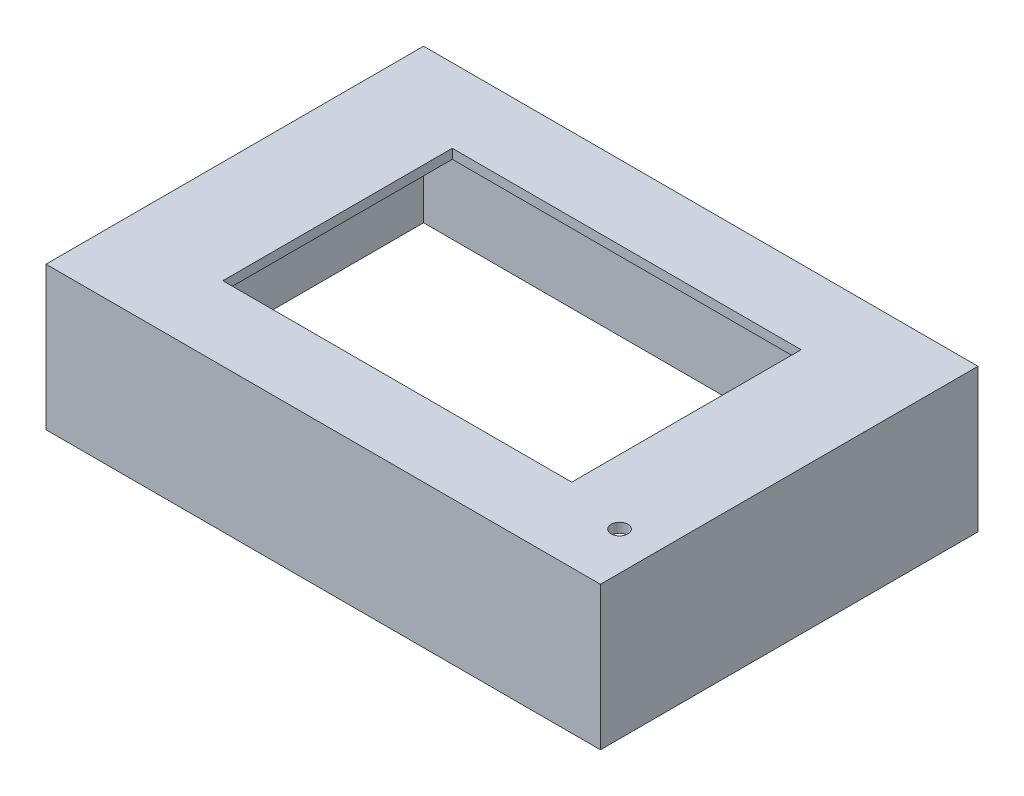
ISO-10303-21;
HEADER;
FILE_DESCRIPTION(('STEP AP214'),'2;1');
FILE_NAME('part.step','',(''),(''),'','','');
FILE_SCHEMA(('AUTOMOTIVE_DESIGN { 1 0 10303 214 1 1 1 1 }'));
ENDSEC;
DATA;
#1=APPLICATION_CONTEXT('core data for automotive mechanical design processes');
#2=APPLICATION_PROTOCOL_DEFINITION('international standard','automotive_design',2000,#1);
#3=PRODUCT_CONTEXT('',#1,'mechanical');
#4=PRODUCT('Part','Part','',(#3));
#5=PRODUCT_RELATED_PRODUCT_CATEGORY('part','',(#4));
#6=PRODUCT_DEFINITION_FORMATION('','',#4);
#7=PRODUCT_DEFINITION_CONTEXT('part definition',#1,'design');
#8=PRODUCT_DEFINITION('design','',#6,#7);
#9=PRODUCT_DEFINITION_SHAPE('','',#8);
#10=(LENGTH_UNIT() NAMED_UNIT(*) SI_UNIT(.MILLI.,.METRE.));
#11=(NAMED_UNIT(*) PLANE_ANGLE_UNIT() SI_UNIT($,.RADIAN.));
#12=(NAMED_UNIT(*) SI_UNIT($,.STERADIAN.) SOLID_ANGLE_UNIT());
#13=UNCERTAINTY_MEASURE_WITH_UNIT(LENGTH_MEASURE(1.E-05),#10,'distance_accuracy_value','');
#14=(GEOMETRIC_REPRESENTATION_CONTEXT(3) GLOBAL_UNCERTAINTY_ASSIGNED_CONTEXT((#13)) GLOBAL_UNIT_ASSIGNED_CONTEXT((#10,
#11,#12)) REPRESENTATION_CONTEXT('',''));
#15=CARTESIAN_POINT('',(0.,0.,0.));
#16=DIRECTION('',(0.,0.,1.));
#17=DIRECTION('',(1.,0.,0.));
#18=AXIS2_PLACEMENT_3D('',#15,#16,#17);
#19=CARTESIAN_POINT('',(0.,0.,0.));
#20=DIRECTION('',(0.,1.,0.));
#21=DIRECTION('',(0.,0.,1.));
#22=AXIS2_PLACEMENT_3D('',#19,#20,#21);
#23=PLANE('',#22);
#24=DIRECTION('',(0.,0.,-1.));
#25=VECTOR('',#24,1.);
#26=CARTESIAN_POINT('',(58.,0.,39.5));
#27=LINE('',#26,#25);
#28=CARTESIAN_POINT('',(58.,0.,39.5));
#29=VERTEX_POINT('',#28);
#30=CARTESIAN_POINT('',(58.,0.,-39.5));
#31=VERTEX_POINT('',#30);
#32=EDGE_CURVE('E199',#29,#31,#27,.T.);
#33=ORIENTED_EDGE('',*,*,#32,.F.);
#34=DIRECTION('',(1.,0.,0.));
#35=VECTOR('',#34,1.);
#36=CARTESIAN_POINT('',(58.,0.,39.5));
#37=LINE('',#36,#35);
#38=CARTESIAN_POINT('',(-58.,0.,39.5));
#39=VERTEX_POINT('',#38);
#40=EDGE_CURVE('E206',#39,#29,#37,.T.);
#41=ORIENTED_EDGE('',*,*,#40,.F.);
#42=DIRECTION('',(0.,0.,1.));
#43=VECTOR('',#42,1.);
#44=CARTESIAN_POINT('',(-58.,0.,39.5));
#45=LINE('',#44,#43);
#46=CARTESIAN_POINT('',(-58.,0.,-39.5));
#47=VERTEX_POINT('',#46);
#48=EDGE_CURVE('E204',#47,#39,#45,.T.);
#49=ORIENTED_EDGE('',*,*,#48,.F.);
#50=DIRECTION('',(-1.,0.,0.));
#51=VECTOR('',#50,1.);
#52=CARTESIAN_POINT('',(58.,0.,-39.5));
#53=LINE('',#52,#51);
#54=EDGE_CURVE('E202',#31,#47,#53,.T.);
#55=ORIENTED_EDGE('',*,*,#54,.F.);
#56=EDGE_LOOP('',(#33,#41,#49,#55));
#57=FACE_BOUND('',#56,.T.);
#58=DIRECTION('',(0.,0.,1.));
#59=VECTOR('',#58,1.);
#60=CARTESIAN_POINT('',(-56.,0.,37.5));
#61=LINE('',#60,#59);
#62=CARTESIAN_POINT('',(-56.,0.,-37.5));
#63=VERTEX_POINT('',#62);
#64=CARTESIAN_POINT('',(-56.,0.,37.5));
#65=VERTEX_POINT('',#64);
#66=EDGE_CURVE('E165',#63,#65,#61,.T.);
#67=ORIENTED_EDGE('',*,*,#66,.T.);
#68=DIRECTION('',(1.,0.,0.));
#69=VECTOR('',#68,1.);
#70=CARTESIAN_POINT('',(56.,0.,37.5));
#71=LINE('',#70,#69);
#72=CARTESIAN_POINT('',(56.,0.,37.5));
#73=VERTEX_POINT('',#72);
#74=EDGE_CURVE('E182',#65,#73,#71,.T.);
#75=ORIENTED_EDGE('',*,*,#74,.T.);
#76=DIRECTION('',(0.,0.,-1.));
#77=VECTOR('',#76,1.);
#78=CARTESIAN_POINT('',(56.,0.,37.5));
#79=LINE('',#78,#77);
#80=CARTESIAN_POINT('',(56.,0.,-37.5));
#81=VERTEX_POINT('',#80);
#82=EDGE_CURVE('E185',#73,#81,#79,.T.);
#83=ORIENTED_EDGE('',*,*,#82,.T.);
#84=DIRECTION('',(-1.,0.,0.));
#85=VECTOR('',#84,1.);
#86=CARTESIAN_POINT('',(56.,0.,-37.5));
#87=LINE('',#86,#85);
#88=EDGE_CURVE('E170',#81,#63,#87,.T.);
#89=ORIENTED_EDGE('',*,*,#88,.T.);
#90=EDGE_LOOP('',(#67,#75,#83,#89));
#91=FACE_BOUND('',#90,.T.);
#92=ADVANCED_FACE('F33',(#57,#91),#23,.F.);
#93=CARTESIAN_POINT('',(58.,28.,39.5));
#94=DIRECTION('',(-1.,0.,0.));
#95=DIRECTION('',(0.,0.,1.));
#96=AXIS2_PLACEMENT_3D('',#93,#94,#95);
#97=PLANE('',#96);
#98=ORIENTED_EDGE('',*,*,#32,.T.);
#99=DIRECTION('',(0.,-1.,0.));
#100=VECTOR('',#99,1.);
#101=CARTESIAN_POINT('',(58.,28.,-39.5));
#102=LINE('',#101,#100);
#103=CARTESIAN_POINT('',(58.,30.,-39.5));
#104=VERTEX_POINT('',#103);
#105=EDGE_CURVE('E11',#104,#31,#102,.T.);
#106=ORIENTED_EDGE('',*,*,#105,.F.);
#107=DIRECTION('',(0.,0.,-1.));
#108=VECTOR('',#107,1.);
#109=CARTESIAN_POINT('',(58.,30.,39.5));
#110=LINE('',#109,#108);
#111=CARTESIAN_POINT('',(58.,30.,39.5));
#112=VERTEX_POINT('',#111);
#113=EDGE_CURVE('E159',#112,#104,#110,.T.);
#114=ORIENTED_EDGE('',*,*,#113,.F.);
#115=DIRECTION('',(0.,-1.,0.));
#116=VECTOR('',#115,1.);
#117=CARTESIAN_POINT('',(58.,28.,39.5));
#118=LINE('',#117,#116);
#119=EDGE_CURVE('E208',#112,#29,#118,.T.);
#120=ORIENTED_EDGE('',*,*,#119,.T.);
#121=EDGE_LOOP('',(#98,#106,#114,#120));
#122=FACE_BOUND('',#121,.T.);
#123=ADVANCED_FACE('F35',(#122),#97,.F.);
#124=CARTESIAN_POINT('',(58.,28.,-39.5));
#125=DIRECTION('',(0.,0.,1.));
#126=DIRECTION('',(1.,0.,0.));
#127=AXIS2_PLACEMENT_3D('',#124,#125,#126);
#128=PLANE('',#127);
#129=ORIENTED_EDGE('',*,*,#54,.T.);
#130=DIRECTION('',(0.,-1.,0.));
#131=VECTOR('',#130,1.);
#132=CARTESIAN_POINT('',(-58.,28.,-39.5));
#133=LINE('',#132,#131);
#134=CARTESIAN_POINT('',(-58.,30.,-39.5));
#135=VERTEX_POINT('',#134);
#136=EDGE_CURVE('E41',#135,#47,#133,.T.);
#137=ORIENTED_EDGE('',*,*,#136,.F.);
#138=DIRECTION('',(-1.,0.,0.));
#139=VECTOR('',#138,1.);
#140=CARTESIAN_POINT('',(58.,30.,-39.5));
#141=LINE('',#140,#139);
#142=EDGE_CURVE('E162',#104,#135,#141,.T.);
#143=ORIENTED_EDGE('',*,*,#142,.F.);
#144=ORIENTED_EDGE('',*,*,#105,.T.);
#145=EDGE_LOOP('',(#129,#137,#143,#144));
#146=FACE_BOUND('',#145,.T.);
#147=ADVANCED_FACE('F229',(#146),#128,.F.);
#148=CARTESIAN_POINT('',(-58.,28.,39.5));
#149=DIRECTION('',(1.,0.,0.));
#150=DIRECTION('',(0.,0.,-1.));
#151=AXIS2_PLACEMENT_3D('',#148,#149,#150);
#152=PLANE('',#151);
#153=ORIENTED_EDGE('',*,*,#48,.T.);
#154=DIRECTION('',(0.,-1.,0.));
#155=VECTOR('',#154,1.);
#156=CARTESIAN_POINT('',(-58.,28.,39.5));
#157=LINE('',#156,#155);
#158=CARTESIAN_POINT('',(-58.,30.,39.5));
#159=VERTEX_POINT('',#158);
#160=EDGE_CURVE('E211',#159,#39,#157,.T.);
#161=ORIENTED_EDGE('',*,*,#160,.F.);
#162=DIRECTION('',(0.,0.,1.));
#163=VECTOR('',#162,1.);
#164=CARTESIAN_POINT('',(-58.,30.,39.5));
#165=LINE('',#164,#163);
#166=EDGE_CURVE('E152',#135,#159,#165,.T.);
#167=ORIENTED_EDGE('',*,*,#166,.F.);
#168=ORIENTED_EDGE('',*,*,#136,.T.);
#169=EDGE_LOOP('',(#153,#161,#167,#168));
#170=FACE_BOUND('',#169,.T.);
#171=ADVANCED_FACE('F217',(#170),#152,.F.);
#172=CARTESIAN_POINT('',(58.,28.,39.5));
#173=DIRECTION('',(0.,0.,-1.));
#174=DIRECTION('',(-1.,0.,0.));
#175=AXIS2_PLACEMENT_3D('',#172,#173,#174);
#176=PLANE('',#175);
#177=ORIENTED_EDGE('',*,*,#40,.T.);
#178=ORIENTED_EDGE('',*,*,#119,.F.);
#179=DIRECTION('',(1.,0.,0.));
#180=VECTOR('',#179,1.);
#181=CARTESIAN_POINT('',(58.,30.,39.5));
#182=LINE('',#181,#180);
#183=EDGE_CURVE('E156',#159,#112,#182,.T.);
#184=ORIENTED_EDGE('',*,*,#183,.F.);
#185=ORIENTED_EDGE('',*,*,#160,.T.);
#186=EDGE_LOOP('',(#177,#178,#184,#185));
#187=FACE_BOUND('',#186,.T.);
#188=ADVANCED_FACE('F225',(#187),#176,.F.);
#189=CARTESIAN_POINT('',(-56.,28.,37.5));
#190=DIRECTION('',(1.,0.,0.));
#191=DIRECTION('',(0.,0.,-1.));
#192=AXIS2_PLACEMENT_3D('',#189,#190,#191);
#193=PLANE('',#192);
#194=ORIENTED_EDGE('',*,*,#66,.F.);
#195=DIRECTION('',(0.,-1.,0.));
#196=VECTOR('',#195,1.);
#197=CARTESIAN_POINT('',(-56.,28.,-37.5));
#198=LINE('',#197,#196);
#199=CARTESIAN_POINT('',(-56.,28.,-37.5));
#200=VERTEX_POINT('',#199);
#201=EDGE_CURVE('E179',#200,#63,#198,.T.);
#202=ORIENTED_EDGE('',*,*,#201,.F.);
#203=DIRECTION('',(0.,0.,1.));
#204=VECTOR('',#203,1.);
#205=CARTESIAN_POINT('',(-56.,28.,37.5));
#206=LINE('',#205,#204);
#207=CARTESIAN_POINT('',(-56.,28.,37.5));
#208=VERTEX_POINT('',#207);
#209=EDGE_CURVE('E166',#200,#208,#206,.T.);
#210=ORIENTED_EDGE('',*,*,#209,.T.);
#211=DIRECTION('',(0.,-1.,0.));
#212=VECTOR('',#211,1.);
#213=CARTESIAN_POINT('',(-56.,28.,37.5));
#214=LINE('',#213,#212);
#215=EDGE_CURVE('E196',#208,#65,#214,.T.);
#216=ORIENTED_EDGE('',*,*,#215,.T.);
#217=EDGE_LOOP('',(#194,#202,#210,#216));
#218=FACE_BOUND('',#217,.T.);
#219=ADVANCED_FACE('F242',(#218),#193,.T.);
#220=CARTESIAN_POINT('',(56.,28.,37.5));
#221=DIRECTION('',(0.,0.,-1.));
#222=DIRECTION('',(-1.,0.,0.));
#223=AXIS2_PLACEMENT_3D('',#220,#221,#222);
#224=PLANE('',#223);
#225=ORIENTED_EDGE('',*,*,#74,.F.);
#226=ORIENTED_EDGE('',*,*,#215,.F.);
#227=DIRECTION('',(1.,0.,0.));
#228=VECTOR('',#227,1.);
#229=CARTESIAN_POINT('',(56.,28.,37.5));
#230=LINE('',#229,#228);
#231=CARTESIAN_POINT('',(56.,28.,37.5));
#232=VERTEX_POINT('',#231);
#233=EDGE_CURVE('E169',#208,#232,#230,.T.);
#234=ORIENTED_EDGE('',*,*,#233,.T.);
#235=DIRECTION('',(0.,-1.,0.));
#236=VECTOR('',#235,1.);
#237=CARTESIAN_POINT('',(56.,28.,37.5));
#238=LINE('',#237,#236);
#239=EDGE_CURVE('E194',#232,#73,#238,.T.);
#240=ORIENTED_EDGE('',*,*,#239,.T.);
#241=EDGE_LOOP('',(#225,#226,#234,#240));
#242=FACE_BOUND('',#241,.T.);
#243=ADVANCED_FACE('F248',(#242),#224,.T.);
#244=CARTESIAN_POINT('',(56.,28.,37.5));
#245=DIRECTION('',(-1.,0.,0.));
#246=DIRECTION('',(0.,0.,1.));
#247=AXIS2_PLACEMENT_3D('',#244,#245,#246);
#248=PLANE('',#247);
#249=ORIENTED_EDGE('',*,*,#82,.F.);
#250=ORIENTED_EDGE('',*,*,#239,.F.);
#251=DIRECTION('',(0.,0.,-1.));
#252=VECTOR('',#251,1.);
#253=CARTESIAN_POINT('',(56.,28.,37.5));
#254=LINE('',#253,#252);
#255=CARTESIAN_POINT('',(56.,28.,-37.5));
#256=VERTEX_POINT('',#255);
#257=EDGE_CURVE('E173',#232,#256,#254,.T.);
#258=ORIENTED_EDGE('',*,*,#257,.T.);
#259=DIRECTION('',(0.,-1.,0.));
#260=VECTOR('',#259,1.);
#261=CARTESIAN_POINT('',(56.,28.,-37.5));
#262=LINE('',#261,#260);
#263=EDGE_CURVE('E192',#256,#81,#262,.T.);
#264=ORIENTED_EDGE('',*,*,#263,.T.);
#265=EDGE_LOOP('',(#249,#250,#258,#264));
#266=FACE_BOUND('',#265,.T.);
#267=ADVANCED_FACE('F253',(#266),#248,.T.);
#268=CARTESIAN_POINT('',(56.,28.,-37.5));
#269=DIRECTION('',(0.,0.,1.));
#270=DIRECTION('',(1.,0.,0.));
#271=AXIS2_PLACEMENT_3D('',#268,#269,#270);
#272=PLANE('',#271);
#273=ORIENTED_EDGE('',*,*,#88,.F.);
#274=ORIENTED_EDGE('',*,*,#263,.F.);
#275=DIRECTION('',(-1.,0.,0.));
#276=VECTOR('',#275,1.);
#277=CARTESIAN_POINT('',(56.,28.,-37.5));
#278=LINE('',#277,#276);
#279=EDGE_CURVE('E176',#256,#200,#278,.T.);
#280=ORIENTED_EDGE('',*,*,#279,.T.);
#281=ORIENTED_EDGE('',*,*,#201,.T.);
#282=EDGE_LOOP('',(#273,#274,#280,#281));
#283=FACE_BOUND('',#282,.T.);
#284=ADVANCED_FACE('F259',(#283),#272,.T.);
#285=CARTESIAN_POINT('',(0.,28.,0.));
#286=DIRECTION('',(0.,1.,0.));
#287=DIRECTION('',(0.,0.,1.));
#288=AXIS2_PLACEMENT_3D('',#285,#286,#287);
#289=PLANE('',#288);
#290=CARTESIAN_POINT('',(50.,28.,27.5));
#291=DIRECTION('',(0.,1.,0.));
#292=DIRECTION('',(0.,0.,1.));
#293=AXIS2_PLACEMENT_3D('',#290,#291,#292);
#294=CIRCLE('',#293,1.75);
#295=CARTESIAN_POINT('',(50.,28.,29.25));
#296=VERTEX_POINT('',#295);
#297=EDGE_CURVE('E351',#296,#296,#294,.F.);
#298=ORIENTED_EDGE('',*,*,#297,.F.);
#299=EDGE_LOOP('',(#298));
#300=FACE_BOUND('',#299,.T.);
#301=DIRECTION('',(-1.,0.,0.));
#302=VECTOR('',#301,1.);
#303=CARTESIAN_POINT('',(-36.5,28.,24.));
#304=LINE('',#303,#302);
#305=CARTESIAN_POINT('',(36.5,28.,24.));
#306=VERTEX_POINT('',#305);
#307=CARTESIAN_POINT('',(-36.5,28.,24.));
#308=VERTEX_POINT('',#307);
#309=EDGE_CURVE('E359',#306,#308,#304,.T.);
#310=ORIENTED_EDGE('',*,*,#309,.F.);
#311=DIRECTION('',(0.,0.,1.));
#312=VECTOR('',#311,1.);
#313=CARTESIAN_POINT('',(36.5,28.,-24.));
#314=LINE('',#313,#312);
#315=CARTESIAN_POINT('',(36.5,28.,-24.));
#316=VERTEX_POINT('',#315);
#317=EDGE_CURVE('E153',#316,#306,#314,.T.);
#318=ORIENTED_EDGE('',*,*,#317,.F.);
#319=DIRECTION('',(1.,0.,0.));
#320=VECTOR('',#319,1.);
#321=CARTESIAN_POINT('',(-36.5,28.,-24.));
#322=LINE('',#321,#320);
#323=CARTESIAN_POINT('',(-36.5,28.,-24.));
#324=VERTEX_POINT('',#323);
#325=EDGE_CURVE('E150',#324,#316,#322,.T.);
#326=ORIENTED_EDGE('',*,*,#325,.F.);
#327=DIRECTION('',(0.,0.,-1.));
#328=VECTOR('',#327,1.);
#329=CARTESIAN_POINT('',(-36.5,28.,-24.));
#330=LINE('',#329,#328);
#331=EDGE_CURVE('E128',#308,#324,#330,.T.);
#332=ORIENTED_EDGE('',*,*,#331,.F.);
#333=EDGE_LOOP('',(#310,#318,#326,#332));
#334=FACE_BOUND('',#333,.T.);
#335=ORIENTED_EDGE('',*,*,#209,.F.);
#336=ORIENTED_EDGE('',*,*,#279,.F.);
#337=ORIENTED_EDGE('',*,*,#257,.F.);
#338=ORIENTED_EDGE('',*,*,#233,.F.);
#339=EDGE_LOOP('',(#335,#336,#337,#338));
#340=FACE_BOUND('',#339,.T.);
#341=ADVANCED_FACE('F265',(#300,#334,#340),#289,.F.);
#342=CARTESIAN_POINT('',(0.,30.,0.));
#343=DIRECTION('',(0.,1.,0.));
#344=DIRECTION('',(0.,0.,1.));
#345=AXIS2_PLACEMENT_3D('',#342,#343,#344);
#346=PLANE('',#345);
#347=CARTESIAN_POINT('',(50.,30.,27.5));
#348=DIRECTION('',(0.,1.,0.));
#349=DIRECTION('',(0.,0.,1.));
#350=AXIS2_PLACEMENT_3D('',#347,#348,#349);
#351=CIRCLE('',#350,1.75);
#352=CARTESIAN_POINT('',(50.,30.,29.25));
#353=VERTEX_POINT('',#352);
#354=EDGE_CURVE('E354',#353,#353,#351,.T.);
#355=ORIENTED_EDGE('',*,*,#354,.F.);
#356=EDGE_LOOP('',(#355));
#357=FACE_BOUND('',#356,.T.);
#358=DIRECTION('',(0.,0.,-1.));
#359=VECTOR('',#358,1.);
#360=CARTESIAN_POINT('',(36.5,30.,-24.));
#361=LINE('',#360,#359);
#362=CARTESIAN_POINT('',(36.5,30.,24.));
#363=VERTEX_POINT('',#362);
#364=CARTESIAN_POINT('',(36.5,30.,-24.));
#365=VERTEX_POINT('',#364);
#366=EDGE_CURVE('E56',#363,#365,#361,.T.);
#367=ORIENTED_EDGE('',*,*,#366,.F.);
#368=DIRECTION('',(1.,0.,0.));
#369=VECTOR('',#368,1.);
#370=CARTESIAN_POINT('',(-36.5,30.,24.));
#371=LINE('',#370,#369);
#372=CARTESIAN_POINT('',(-36.5,30.,24.));
#373=VERTEX_POINT('',#372);
#374=EDGE_CURVE('E141',#373,#363,#371,.T.);
#375=ORIENTED_EDGE('',*,*,#374,.F.);
#376=DIRECTION('',(0.,0.,1.));
#377=VECTOR('',#376,1.);
#378=CARTESIAN_POINT('',(-36.5,30.,-24.));
#379=LINE('',#378,#377);
#380=CARTESIAN_POINT('',(-36.5,30.,-24.));
#381=VERTEX_POINT('',#380);
#382=EDGE_CURVE('E125',#381,#373,#379,.T.);
#383=ORIENTED_EDGE('',*,*,#382,.F.);
#384=DIRECTION('',(-1.,0.,0.));
#385=VECTOR('',#384,1.);
#386=CARTESIAN_POINT('',(-36.5,30.,-24.));
#387=LINE('',#386,#385);
#388=EDGE_CURVE('E134',#365,#381,#387,.T.);
#389=ORIENTED_EDGE('',*,*,#388,.F.);
#390=EDGE_LOOP('',(#367,#375,#383,#389));
#391=FACE_BOUND('',#390,.T.);
#392=ORIENTED_EDGE('',*,*,#166,.T.);
#393=ORIENTED_EDGE('',*,*,#183,.T.);
#394=ORIENTED_EDGE('',*,*,#113,.T.);
#395=ORIENTED_EDGE('',*,*,#142,.T.);
#396=EDGE_LOOP('',(#392,#393,#394,#395));
#397=FACE_BOUND('',#396,.T.);
#398=ADVANCED_FACE('F138',(#357,#391,#397),#346,.T.);
#399=CARTESIAN_POINT('',(36.5,-59.3670418407308,-24.));
#400=DIRECTION('',(1.,0.,0.));
#401=DIRECTION('',(0.,0.,-1.));
#402=AXIS2_PLACEMENT_3D('',#399,#400,#401);
#403=PLANE('',#402);
#404=ORIENTED_EDGE('',*,*,#317,.T.);
#405=DIRECTION('',(0.,1.,0.));
#406=VECTOR('',#405,1.);
#407=CARTESIAN_POINT('',(36.5,-59.3670418407308,24.));
#408=LINE('',#407,#406);
#409=EDGE_CURVE('E146',#306,#363,#408,.T.);
#410=ORIENTED_EDGE('',*,*,#409,.T.);
#411=ORIENTED_EDGE('',*,*,#366,.T.);
#412=DIRECTION('',(0.,1.,0.));
#413=VECTOR('',#412,1.);
#414=CARTESIAN_POINT('',(36.5,-59.3670418407308,-24.));
#415=LINE('',#414,#413);
#416=EDGE_CURVE('E131',#316,#365,#415,.T.);
#417=ORIENTED_EDGE('',*,*,#416,.F.);
#418=EDGE_LOOP('',(#404,#410,#411,#417));
#419=FACE_BOUND('',#418,.T.);
#420=ADVANCED_FACE('F273',(#419),#403,.F.);
#421=CARTESIAN_POINT('',(-36.5,-59.3670418407308,24.));
#422=DIRECTION('',(0.,0.,1.));
#423=DIRECTION('',(1.,0.,0.));
#424=AXIS2_PLACEMENT_3D('',#421,#422,#423);
#425=PLANE('',#424);
#426=ORIENTED_EDGE('',*,*,#309,.T.);
#427=DIRECTION('',(0.,1.,0.));
#428=VECTOR('',#427,1.);
#429=CARTESIAN_POINT('',(-36.5,-59.3670418407308,24.));
#430=LINE('',#429,#428);
#431=EDGE_CURVE('E130',#308,#373,#430,.T.);
#432=ORIENTED_EDGE('',*,*,#431,.T.);
#433=ORIENTED_EDGE('',*,*,#374,.T.);
#434=ORIENTED_EDGE('',*,*,#409,.F.);
#435=EDGE_LOOP('',(#426,#432,#433,#434));
#436=FACE_BOUND('',#435,.T.);
#437=ADVANCED_FACE('F300',(#436),#425,.F.);
#438=CARTESIAN_POINT('',(-36.5,-59.3670418407308,-24.));
#439=DIRECTION('',(-1.,0.,0.));
#440=DIRECTION('',(0.,0.,1.));
#441=AXIS2_PLACEMENT_3D('',#438,#439,#440);
#442=PLANE('',#441);
#443=ORIENTED_EDGE('',*,*,#331,.T.);
#444=DIRECTION('',(0.,1.,0.));
#445=VECTOR('',#444,1.);
#446=CARTESIAN_POINT('',(-36.5,-59.3670418407308,-24.));
#447=LINE('',#446,#445);
#448=EDGE_CURVE('E48',#324,#381,#447,.T.);
#449=ORIENTED_EDGE('',*,*,#448,.T.);
#450=ORIENTED_EDGE('',*,*,#382,.T.);
#451=ORIENTED_EDGE('',*,*,#431,.F.);
#452=EDGE_LOOP('',(#443,#449,#450,#451));
#453=FACE_BOUND('',#452,.T.);
#454=ADVANCED_FACE('F122',(#453),#442,.F.);
#455=CARTESIAN_POINT('',(-36.5,-59.3670418407308,-24.));
#456=DIRECTION('',(0.,0.,-1.));
#457=DIRECTION('',(-1.,0.,0.));
#458=AXIS2_PLACEMENT_3D('',#455,#456,#457);
#459=PLANE('',#458);
#460=ORIENTED_EDGE('',*,*,#325,.T.);
#461=ORIENTED_EDGE('',*,*,#416,.T.);
#462=ORIENTED_EDGE('',*,*,#388,.T.);
#463=ORIENTED_EDGE('',*,*,#448,.F.);
#464=EDGE_LOOP('',(#460,#461,#462,#463));
#465=FACE_BOUND('',#464,.T.);
#466=ADVANCED_FACE('F135',(#465),#459,.F.);
#467=CARTESIAN_POINT('',(50.,23.0502525316942,27.5));
#468=DIRECTION('',(0.,1.,0.));
#469=DIRECTION('',(0.,0.,1.));
#470=AXIS2_PLACEMENT_3D('',#467,#468,#469);
#471=CYLINDRICAL_SURFACE('',#470,1.75);
#472=ORIENTED_EDGE('',*,*,#297,.T.);
#473=EDGE_LOOP('',(#472));
#474=FACE_BOUND('',#473,.T.);
#475=ORIENTED_EDGE('',*,*,#354,.T.);
#476=EDGE_LOOP('',(#475));
#477=FACE_BOUND('',#476,.T.);
#478=ADVANCED_FACE('F325',(#474,#477),#471,.F.);
#479=CLOSED_SHELL('',(#92,#123,#147,#171,#188,#219,#243,#267,#284,#341,#398,#420,#437,#454,#466,#478));
#480=MANIFOLD_SOLID_BREP('B2',#479);
#481=ADVANCED_BREP_SHAPE_REPRESENTATION('',(#18,#480),#14);
#482=SHAPE_DEFINITION_REPRESENTATION(#9,#481);
ENDSEC;
END-ISO-10303-21;
